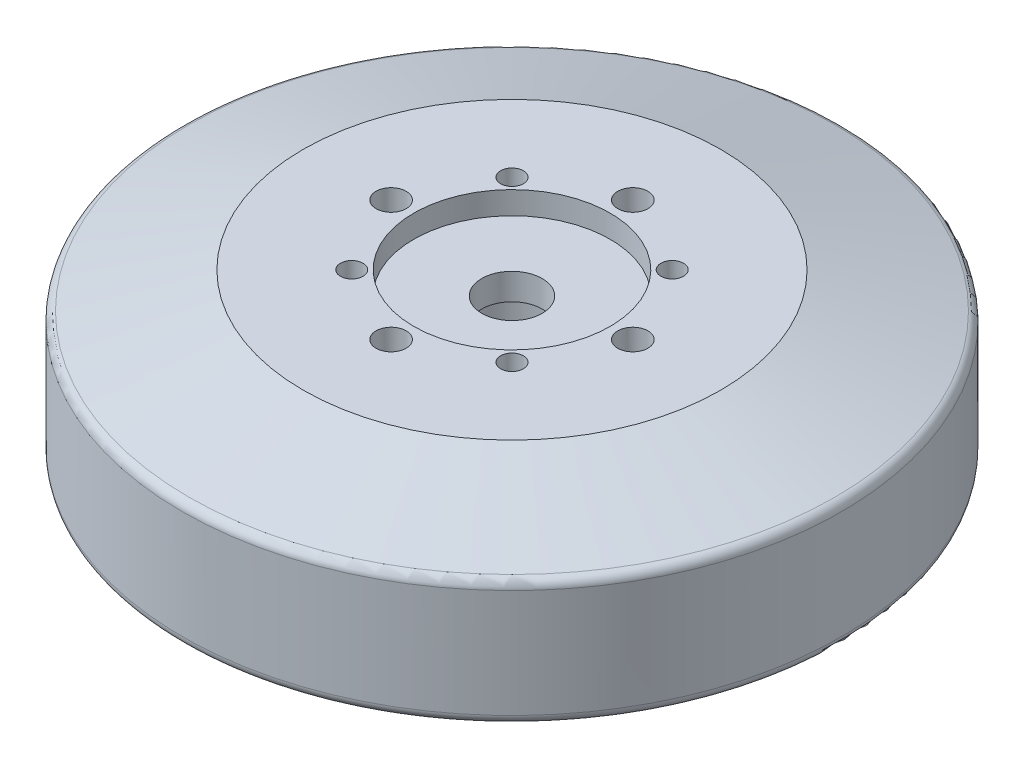
ISO-10303-21;
HEADER;
FILE_DESCRIPTION(('STEP AP214'),'2;1');
FILE_NAME('part.step','',(''),(''),'','','');
FILE_SCHEMA(('AUTOMOTIVE_DESIGN { 1 0 10303 214 1 1 1 1 }'));
ENDSEC;
DATA;
#1=APPLICATION_CONTEXT('core data for automotive mechanical design processes');
#2=APPLICATION_PROTOCOL_DEFINITION('international standard','automotive_design',2000,#1);
#3=PRODUCT_CONTEXT('',#1,'mechanical');
#4=PRODUCT('Part','Part','',(#3));
#5=PRODUCT_RELATED_PRODUCT_CATEGORY('part','',(#4));
#6=PRODUCT_DEFINITION_FORMATION('','',#4);
#7=PRODUCT_DEFINITION_CONTEXT('part definition',#1,'design');
#8=PRODUCT_DEFINITION('design','',#6,#7);
#9=PRODUCT_DEFINITION_SHAPE('','',#8);
#10=(LENGTH_UNIT() NAMED_UNIT(*) SI_UNIT(.MILLI.,.METRE.));
#11=(NAMED_UNIT(*) PLANE_ANGLE_UNIT() SI_UNIT($,.RADIAN.));
#12=(NAMED_UNIT(*) SI_UNIT($,.STERADIAN.) SOLID_ANGLE_UNIT());
#13=UNCERTAINTY_MEASURE_WITH_UNIT(LENGTH_MEASURE(1.E-05),#10,'distance_accuracy_value','');
#14=(GEOMETRIC_REPRESENTATION_CONTEXT(3) GLOBAL_UNCERTAINTY_ASSIGNED_CONTEXT((#13)) GLOBAL_UNIT_ASSIGNED_CONTEXT((#10,
#11,#12)) REPRESENTATION_CONTEXT('',''));
#15=CARTESIAN_POINT('',(0.,0.,0.));
#16=DIRECTION('',(0.,0.,1.));
#17=DIRECTION('',(1.,0.,0.));
#18=AXIS2_PLACEMENT_3D('',#15,#16,#17);
#19=CARTESIAN_POINT('',(0.,0.,0.));
#20=DIRECTION('',(0.,1.,0.));
#21=DIRECTION('',(0.,0.,1.));
#22=AXIS2_PLACEMENT_3D('',#19,#20,#21);
#23=CYLINDRICAL_SURFACE('',#22,4.);
#24=CARTESIAN_POINT('',(0.,23.5,0.));
#25=DIRECTION('',(0.,1.,0.));
#26=DIRECTION('',(0.,0.,1.));
#27=AXIS2_PLACEMENT_3D('',#24,#25,#26);
#28=CIRCLE('',#27,4.);
#29=CARTESIAN_POINT('',(0.,23.5,4.));
#30=VERTEX_POINT('',#29);
#31=EDGE_CURVE('E50',#30,#30,#28,.T.);
#32=ORIENTED_EDGE('',*,*,#31,.T.);
#33=EDGE_LOOP('',(#32));
#34=FACE_BOUND('',#33,.T.);
#35=CARTESIAN_POINT('',(0.,20.,0.));
#36=DIRECTION('',(0.,-1.,0.));
#37=DIRECTION('',(0.,0.,-1.));
#38=AXIS2_PLACEMENT_3D('',#35,#36,#37);
#39=CIRCLE('',#38,4.);
#40=CARTESIAN_POINT('',(0.,20.,-4.));
#41=VERTEX_POINT('',#40);
#42=EDGE_CURVE('E38',#41,#41,#39,.F.);
#43=ORIENTED_EDGE('',*,*,#42,.F.);
#44=EDGE_LOOP('',(#43));
#45=FACE_BOUND('',#44,.T.);
#46=ADVANCED_FACE('F34',(#34,#45),#23,.F.);
#47=CARTESIAN_POINT('',(0.,26.5,0.));
#48=DIRECTION('',(0.,-1.,0.));
#49=DIRECTION('',(0.,0.,-1.));
#50=AXIS2_PLACEMENT_3D('',#47,#48,#49);
#51=CYLINDRICAL_SURFACE('',#50,43.625);
#52=CARTESIAN_POINT('',(0.,6.24363306261844,0.));
#53=DIRECTION('',(0.,-1.,0.));
#54=DIRECTION('',(0.,0.,-1.));
#55=AXIS2_PLACEMENT_3D('',#52,#53,#54);
#56=CIRCLE('',#55,43.625);
#57=CARTESIAN_POINT('',(0.,6.24363306261844,-43.625));
#58=VERTEX_POINT('',#57);
#59=EDGE_CURVE('E47',#58,#58,#56,.F.);
#60=ORIENTED_EDGE('',*,*,#59,.T.);
#61=EDGE_LOOP('',(#60));
#62=FACE_BOUND('',#61,.T.);
#63=CARTESIAN_POINT('',(0.,20.5663075399947,0.));
#64=DIRECTION('',(0.,1.,0.));
#65=DIRECTION('',(0.,0.,1.));
#66=AXIS2_PLACEMENT_3D('',#63,#64,#65);
#67=CIRCLE('',#66,43.625);
#68=CARTESIAN_POINT('',(0.,20.5663075399947,43.625));
#69=VERTEX_POINT('',#68);
#70=EDGE_CURVE('E94',#69,#69,#67,.F.);
#71=ORIENTED_EDGE('',*,*,#70,.T.);
#72=EDGE_LOOP('',(#71));
#73=FACE_BOUND('',#72,.T.);
#74=ADVANCED_FACE('F99',(#62,#73),#51,.T.);
#75=CARTESIAN_POINT('',(0.,26.5,0.));
#76=DIRECTION('',(0.,1.,0.));
#77=DIRECTION('',(0.,0.,1.));
#78=AXIS2_PLACEMENT_3D('',#75,#76,#77);
#79=PLANE('',#78);
#80=CARTESIAN_POINT('',(-10.6066017177983,26.5,-10.6066017177982));
#81=DIRECTION('',(0.,1.,0.));
#82=DIRECTION('',(1.,0.,0.));
#83=AXIS2_PLACEMENT_3D('',#80,#81,#82);
#84=CIRCLE('',#83,1.5);
#85=CARTESIAN_POINT('',(-9.10660171779827,26.5,-10.6066017177982));
#86=VERTEX_POINT('',#85);
#87=EDGE_CURVE('E672',#86,#86,#84,.T.);
#88=ORIENTED_EDGE('',*,*,#87,.F.);
#89=EDGE_LOOP('',(#88));
#90=FACE_BOUND('',#89,.T.);
#91=CARTESIAN_POINT('',(-16.,26.5,0.));
#92=DIRECTION('',(0.,1.,0.));
#93=DIRECTION('',(0.,0.,-1.));
#94=AXIS2_PLACEMENT_3D('',#91,#92,#93);
#95=CIRCLE('',#94,2.);
#96=CARTESIAN_POINT('',(-16.,26.5,-2.));
#97=VERTEX_POINT('',#96);
#98=EDGE_CURVE('E678',#97,#97,#95,.T.);
#99=ORIENTED_EDGE('',*,*,#98,.F.);
#100=EDGE_LOOP('',(#99));
#101=FACE_BOUND('',#100,.T.);
#102=CARTESIAN_POINT('',(-10.6066017177982,26.5,10.6066017177982));
#103=DIRECTION('',(0.,1.,0.));
#104=DIRECTION('',(0.,0.,-1.));
#105=AXIS2_PLACEMENT_3D('',#102,#103,#104);
#106=CIRCLE('',#105,1.5);
#107=CARTESIAN_POINT('',(-10.6066017177982,26.5,9.10660171779823));
#108=VERTEX_POINT('',#107);
#109=EDGE_CURVE('E684',#108,#108,#106,.T.);
#110=ORIENTED_EDGE('',*,*,#109,.F.);
#111=EDGE_LOOP('',(#110));
#112=FACE_BOUND('',#111,.T.);
#113=CARTESIAN_POINT('',(1.6759110426447E-13,26.5,16.));
#114=DIRECTION('',(0.,1.,0.));
#115=DIRECTION('',(-1.,0.,0.));
#116=AXIS2_PLACEMENT_3D('',#113,#114,#115);
#117=CIRCLE('',#116,2.);
#118=CARTESIAN_POINT('',(-1.99999999999984,26.5,16.));
#119=VERTEX_POINT('',#118);
#120=EDGE_CURVE('E690',#119,#119,#117,.T.);
#121=ORIENTED_EDGE('',*,*,#120,.F.);
#122=EDGE_LOOP('',(#121));
#123=FACE_BOUND('',#122,.T.);
#124=CARTESIAN_POINT('',(10.6066017177983,26.5,10.6066017177981));
#125=DIRECTION('',(0.,1.,0.));
#126=DIRECTION('',(-1.,0.,0.));
#127=AXIS2_PLACEMENT_3D('',#124,#125,#126);
#128=CIRCLE('',#127,1.5);
#129=CARTESIAN_POINT('',(9.10660171779834,26.5,10.6066017177981));
#130=VERTEX_POINT('',#129);
#131=EDGE_CURVE('E665',#130,#130,#128,.T.);
#132=ORIENTED_EDGE('',*,*,#131,.F.);
#133=EDGE_LOOP('',(#132));
#134=FACE_BOUND('',#133,.T.);
#135=CARTESIAN_POINT('',(0.,26.5,-16.));
#136=DIRECTION('',(0.,1.,0.));
#137=DIRECTION('',(1.,0.,0.));
#138=AXIS2_PLACEMENT_3D('',#135,#136,#137);
#139=CIRCLE('',#138,2.);
#140=CARTESIAN_POINT('',(1.99999999999995,26.5,-16.));
#141=VERTEX_POINT('',#140);
#142=EDGE_CURVE('E671',#141,#141,#139,.T.);
#143=ORIENTED_EDGE('',*,*,#142,.F.);
#144=EDGE_LOOP('',(#143));
#145=FACE_BOUND('',#144,.T.);
#146=CARTESIAN_POINT('',(0.,26.5,0.));
#147=DIRECTION('',(0.,1.,0.));
#148=DIRECTION('',(0.,0.,1.));
#149=AXIS2_PLACEMENT_3D('',#146,#147,#148);
#150=CIRCLE('',#149,13.);
#151=CARTESIAN_POINT('',(0.,26.5,13.));
#152=VERTEX_POINT('',#151);
#153=EDGE_CURVE('E52',#152,#152,#150,.T.);
#154=ORIENTED_EDGE('',*,*,#153,.F.);
#155=EDGE_LOOP('',(#154));
#156=FACE_BOUND('',#155,.T.);
#157=CARTESIAN_POINT('',(10.6066017177982,26.5,-10.6066017177982));
#158=DIRECTION('',(0.,1.,0.));
#159=DIRECTION('',(0.,0.,1.));
#160=AXIS2_PLACEMENT_3D('',#157,#158,#159);
#161=CIRCLE('',#160,1.5);
#162=CARTESIAN_POINT('',(10.6066017177982,26.5,-9.10660171779823));
#163=VERTEX_POINT('',#162);
#164=EDGE_CURVE('E75',#163,#163,#161,.T.);
#165=ORIENTED_EDGE('',*,*,#164,.F.);
#166=EDGE_LOOP('',(#165));
#167=FACE_BOUND('',#166,.T.);
#168=CARTESIAN_POINT('',(16.,26.5,0.));
#169=DIRECTION('',(0.,1.,0.));
#170=DIRECTION('',(0.,0.,1.));
#171=AXIS2_PLACEMENT_3D('',#168,#169,#170);
#172=CIRCLE('',#171,2.);
#173=CARTESIAN_POINT('',(16.,26.5,2.));
#174=VERTEX_POINT('',#173);
#175=EDGE_CURVE('E80',#174,#174,#172,.T.);
#176=ORIENTED_EDGE('',*,*,#175,.F.);
#177=EDGE_LOOP('',(#176));
#178=FACE_BOUND('',#177,.T.);
#179=CARTESIAN_POINT('',(0.,26.5,0.));
#180=DIRECTION('',(0.,1.,0.));
#181=DIRECTION('',(0.,0.,1.));
#182=AXIS2_PLACEMENT_3D('',#179,#180,#181);
#183=CIRCLE('',#182,27.6249999999998);
#184=CARTESIAN_POINT('',(0.,26.5,27.6249999999998));
#185=VERTEX_POINT('',#184);
#186=EDGE_CURVE('E86',#185,#185,#183,.T.);
#187=ORIENTED_EDGE('',*,*,#186,.T.);
#188=EDGE_LOOP('',(#187));
#189=FACE_BOUND('',#188,.T.);
#190=ADVANCED_FACE('F121',(#90,#101,#112,#123,#134,#145,#156,#167,#178,#189),#79,.T.);
#191=CARTESIAN_POINT('',(0.,0.,0.));
#192=DIRECTION('',(0.,1.,0.));
#193=DIRECTION('',(0.,0.,1.));
#194=AXIS2_PLACEMENT_3D('',#191,#192,#193);
#195=PLANE('',#194);
#196=CARTESIAN_POINT('',(12.3743686707646,0.,-12.3743686707646));
#197=DIRECTION('',(0.,-1.,0.));
#198=DIRECTION('',(0.,0.,1.));
#199=AXIS2_PLACEMENT_3D('',#196,#197,#198);
#200=CIRCLE('',#199,1.5);
#201=CARTESIAN_POINT('',(12.3743686707646,0.,-10.8743686707646));
#202=VERTEX_POINT('',#201);
#203=EDGE_CURVE('E623',#202,#202,#200,.T.);
#204=ORIENTED_EDGE('',*,*,#203,.F.);
#205=EDGE_LOOP('',(#204));
#206=FACE_BOUND('',#205,.T.);
#207=CARTESIAN_POINT('',(-17.5,0.,1.83302770289265E-13));
#208=DIRECTION('',(0.,-1.,0.));
#209=DIRECTION('',(1.,0.,0.));
#210=AXIS2_PLACEMENT_3D('',#207,#208,#209);
#211=CIRCLE('',#210,1.5);
#212=CARTESIAN_POINT('',(-16.,0.,1.6759110426447E-13));
#213=VERTEX_POINT('',#212);
#214=EDGE_CURVE('E637',#213,#213,#211,.T.);
#215=ORIENTED_EDGE('',*,*,#214,.F.);
#216=EDGE_LOOP('',(#215));
#217=FACE_BOUND('',#216,.T.);
#218=CARTESIAN_POINT('',(-12.5,0.,1.30930550206618E-13));
#219=DIRECTION('',(0.,-1.,0.));
#220=DIRECTION('',(1.,0.,0.));
#221=AXIS2_PLACEMENT_3D('',#218,#219,#220);
#222=CIRCLE('',#221,1.5);
#223=CARTESIAN_POINT('',(-11.,0.,1.15218884181823E-13));
#224=VERTEX_POINT('',#223);
#225=EDGE_CURVE('E789',#224,#224,#222,.T.);
#226=ORIENTED_EDGE('',*,*,#225,.F.);
#227=EDGE_LOOP('',(#226));
#228=FACE_BOUND('',#227,.T.);
#229=CARTESIAN_POINT('',(-12.3743686707647,0.,-12.3743686707645));
#230=DIRECTION('',(0.,-1.,0.));
#231=DIRECTION('',(1.,0.,0.));
#232=AXIS2_PLACEMENT_3D('',#229,#230,#231);
#233=CIRCLE('',#232,1.5);
#234=CARTESIAN_POINT('',(-10.8743686707647,0.,-12.3743686707645));
#235=VERTEX_POINT('',#234);
#236=EDGE_CURVE('E632',#235,#235,#233,.T.);
#237=ORIENTED_EDGE('',*,*,#236,.F.);
#238=EDGE_LOOP('',(#237));
#239=FACE_BOUND('',#238,.T.);
#240=CARTESIAN_POINT('',(0.,0.,-12.5));
#241=DIRECTION('',(0.,-1.,0.));
#242=DIRECTION('',(0.,0.,1.));
#243=AXIS2_PLACEMENT_3D('',#240,#241,#242);
#244=CIRCLE('',#243,1.5);
#245=CARTESIAN_POINT('',(0.,0.,-11.));
#246=VERTEX_POINT('',#245);
#247=EDGE_CURVE('E622',#246,#246,#244,.T.);
#248=ORIENTED_EDGE('',*,*,#247,.F.);
#249=EDGE_LOOP('',(#248));
#250=FACE_BOUND('',#249,.T.);
#251=CARTESIAN_POINT('',(0.,0.,-17.5));
#252=DIRECTION('',(0.,-1.,0.));
#253=DIRECTION('',(0.,0.,1.));
#254=AXIS2_PLACEMENT_3D('',#251,#252,#253);
#255=CIRCLE('',#254,1.5);
#256=CARTESIAN_POINT('',(0.,0.,-16.));
#257=VERTEX_POINT('',#256);
#258=EDGE_CURVE('E657',#257,#257,#255,.T.);
#259=ORIENTED_EDGE('',*,*,#258,.F.);
#260=EDGE_LOOP('',(#259));
#261=FACE_BOUND('',#260,.T.);
#262=CARTESIAN_POINT('',(12.3743686707646,0.,12.3743686707646));
#263=DIRECTION('',(0.,-1.,0.));
#264=DIRECTION('',(-1.,0.,0.));
#265=AXIS2_PLACEMENT_3D('',#262,#263,#264);
#266=CIRCLE('',#265,1.5);
#267=CARTESIAN_POINT('',(10.8743686707646,0.,12.3743686707646));
#268=VERTEX_POINT('',#267);
#269=EDGE_CURVE('E651',#268,#268,#266,.T.);
#270=ORIENTED_EDGE('',*,*,#269,.F.);
#271=EDGE_LOOP('',(#270));
#272=FACE_BOUND('',#271,.T.);
#273=CARTESIAN_POINT('',(12.5,0.,0.));
#274=DIRECTION('',(0.,-1.,0.));
#275=DIRECTION('',(-1.,0.,0.));
#276=AXIS2_PLACEMENT_3D('',#273,#274,#275);
#277=CIRCLE('',#276,1.5);
#278=CARTESIAN_POINT('',(11.,0.,0.));
#279=VERTEX_POINT('',#278);
#280=EDGE_CURVE('E645',#279,#279,#277,.T.);
#281=ORIENTED_EDGE('',*,*,#280,.F.);
#282=EDGE_LOOP('',(#281));
#283=FACE_BOUND('',#282,.T.);
#284=CARTESIAN_POINT('',(17.5,0.,0.));
#285=DIRECTION('',(0.,-1.,0.));
#286=DIRECTION('',(-1.,0.,0.));
#287=AXIS2_PLACEMENT_3D('',#284,#285,#286);
#288=CIRCLE('',#287,1.5);
#289=CARTESIAN_POINT('',(16.,0.,0.));
#290=VERTEX_POINT('',#289);
#291=EDGE_CURVE('E644',#290,#290,#288,.T.);
#292=ORIENTED_EDGE('',*,*,#291,.F.);
#293=EDGE_LOOP('',(#292));
#294=FACE_BOUND('',#293,.T.);
#295=CARTESIAN_POINT('',(0.,0.,12.5));
#296=DIRECTION('',(0.,-1.,0.));
#297=DIRECTION('',(0.,0.,-1.));
#298=AXIS2_PLACEMENT_3D('',#295,#296,#297);
#299=CIRCLE('',#298,1.5);
#300=CARTESIAN_POINT('',(0.,0.,11.));
#301=VERTEX_POINT('',#300);
#302=EDGE_CURVE('E707',#301,#301,#299,.T.);
#303=ORIENTED_EDGE('',*,*,#302,.F.);
#304=EDGE_LOOP('',(#303));
#305=FACE_BOUND('',#304,.T.);
#306=CARTESIAN_POINT('',(-12.3743686707646,0.,12.3743686707646));
#307=DIRECTION('',(0.,-1.,0.));
#308=DIRECTION('',(0.,0.,-1.));
#309=AXIS2_PLACEMENT_3D('',#306,#307,#308);
#310=CIRCLE('',#309,1.5);
#311=CARTESIAN_POINT('',(-12.3743686707646,0.,10.8743686707646));
#312=VERTEX_POINT('',#311);
#313=EDGE_CURVE('E701',#312,#312,#310,.T.);
#314=ORIENTED_EDGE('',*,*,#313,.F.);
#315=EDGE_LOOP('',(#314));
#316=FACE_BOUND('',#315,.T.);
#317=CARTESIAN_POINT('',(0.,0.,17.5));
#318=DIRECTION('',(0.,-1.,0.));
#319=DIRECTION('',(0.,0.,-1.));
#320=AXIS2_PLACEMENT_3D('',#317,#318,#319);
#321=CIRCLE('',#320,1.5);
#322=CARTESIAN_POINT('',(0.,0.,16.));
#323=VERTEX_POINT('',#322);
#324=EDGE_CURVE('E71',#323,#323,#321,.T.);
#325=ORIENTED_EDGE('',*,*,#324,.F.);
#326=EDGE_LOOP('',(#325));
#327=FACE_BOUND('',#326,.T.);
#328=CARTESIAN_POINT('',(0.,0.,0.));
#329=DIRECTION('',(0.,-1.,0.));
#330=DIRECTION('',(0.,0.,-1.));
#331=AXIS2_PLACEMENT_3D('',#328,#329,#330);
#332=CIRCLE('',#331,6.35);
#333=CARTESIAN_POINT('',(0.,0.,-6.35));
#334=VERTEX_POINT('',#333);
#335=EDGE_CURVE('E63',#334,#334,#332,.T.);
#336=ORIENTED_EDGE('',*,*,#335,.F.);
#337=EDGE_LOOP('',(#336));
#338=FACE_BOUND('',#337,.T.);
#339=CARTESIAN_POINT('',(0.,0.,0.));
#340=DIRECTION('',(0.,1.,0.));
#341=DIRECTION('',(0.,0.,1.));
#342=AXIS2_PLACEMENT_3D('',#339,#340,#341);
#343=CIRCLE('',#342,20.6249999999996);
#344=CARTESIAN_POINT('',(0.,0.,20.6249999999996));
#345=VERTEX_POINT('',#344);
#346=EDGE_CURVE('E91',#345,#345,#343,.F.);
#347=ORIENTED_EDGE('',*,*,#346,.T.);
#348=EDGE_LOOP('',(#347));
#349=FACE_BOUND('',#348,.T.);
#350=ADVANCED_FACE('F154',(#206,#217,#228,#239,#250,#261,#272,#283,#294,#305,#316,#327,#338,
#349),#195,.F.);
#351=CARTESIAN_POINT('',(0.,26.5,0.));
#352=DIRECTION('',(0.,-1.,0.));
#353=DIRECTION('',(0.,0.,-1.));
#354=AXIS2_PLACEMENT_3D('',#351,#352,#353);
#355=CONICAL_SURFACE('',#354,27.6249999999998,1.26791145841993);
#356=CARTESIAN_POINT('',(0.,21.7784971120991,0.));
#357=DIRECTION('',(0.,-1.,0.));
#358=DIRECTION('',(0.,0.,-1.));
#359=AXIS2_PLACEMENT_3D('',#356,#357,#358);
#360=CIRCLE('',#359,42.7338092412826);
#361=CARTESIAN_POINT('',(0.,21.7784971120991,-42.7338092412826));
#362=VERTEX_POINT('',#361);
#363=EDGE_CURVE('E10',#362,#362,#360,.F.);
#364=ORIENTED_EDGE('',*,*,#363,.T.);
#365=EDGE_LOOP('',(#364));
#366=FACE_BOUND('',#365,.T.);
#367=ORIENTED_EDGE('',*,*,#186,.F.);
#368=EDGE_LOOP('',(#367));
#369=FACE_BOUND('',#368,.T.);
#370=ADVANCED_FACE('F150',(#366,#369),#355,.T.);
#371=CARTESIAN_POINT('',(16.,20.5,0.));
#372=DIRECTION('',(0.,1.,0.));
#373=DIRECTION('',(0.,0.,1.));
#374=AXIS2_PLACEMENT_3D('',#371,#372,#373);
#375=CYLINDRICAL_SURFACE('',#374,2.);
#376=CARTESIAN_POINT('',(16.,20.5,0.));
#377=DIRECTION('',(0.,1.,0.));
#378=DIRECTION('',(0.,0.,1.));
#379=AXIS2_PLACEMENT_3D('',#376,#377,#378);
#380=CIRCLE('',#379,2.);
#381=CARTESIAN_POINT('',(16.,20.5,2.));
#382=VERTEX_POINT('',#381);
#383=EDGE_CURVE('E83',#382,#382,#380,.T.);
#384=ORIENTED_EDGE('',*,*,#383,.F.);
#385=EDGE_LOOP('',(#384));
#386=FACE_BOUND('',#385,.T.);
#387=ORIENTED_EDGE('',*,*,#175,.T.);
#388=EDGE_LOOP('',(#387));
#389=FACE_BOUND('',#388,.T.);
#390=ADVANCED_FACE('F146',(#386,#389),#375,.F.);
#391=CARTESIAN_POINT('',(16.,20.5,0.));
#392=DIRECTION('',(0.,1.,0.));
#393=DIRECTION('',(0.,0.,1.));
#394=AXIS2_PLACEMENT_3D('',#391,#392,#393);
#395=PLANE('',#394);
#396=ORIENTED_EDGE('',*,*,#383,.T.);
#397=EDGE_LOOP('',(#396));
#398=FACE_BOUND('',#397,.T.);
#399=ADVANCED_FACE('F142',(#398),#395,.T.);
#400=CARTESIAN_POINT('',(10.6066017177982,20.5,-10.6066017177982));
#401=DIRECTION('',(0.,1.,0.));
#402=DIRECTION('',(0.,0.,1.));
#403=AXIS2_PLACEMENT_3D('',#400,#401,#402);
#404=CYLINDRICAL_SURFACE('',#403,1.5);
#405=CARTESIAN_POINT('',(10.6066017177982,20.5,-10.6066017177982));
#406=DIRECTION('',(0.,1.,0.));
#407=DIRECTION('',(0.,0.,1.));
#408=AXIS2_PLACEMENT_3D('',#405,#406,#407);
#409=CIRCLE('',#408,1.5);
#410=CARTESIAN_POINT('',(10.6066017177982,20.5,-9.10660171779823));
#411=VERTEX_POINT('',#410);
#412=EDGE_CURVE('E77',#411,#411,#409,.T.);
#413=ORIENTED_EDGE('',*,*,#412,.F.);
#414=EDGE_LOOP('',(#413));
#415=FACE_BOUND('',#414,.T.);
#416=ORIENTED_EDGE('',*,*,#164,.T.);
#417=EDGE_LOOP('',(#416));
#418=FACE_BOUND('',#417,.T.);
#419=ADVANCED_FACE('F138',(#415,#418),#404,.F.);
#420=CARTESIAN_POINT('',(10.6066017177982,20.5,-10.6066017177982));
#421=DIRECTION('',(0.,1.,0.));
#422=DIRECTION('',(0.,0.,1.));
#423=AXIS2_PLACEMENT_3D('',#420,#421,#422);
#424=PLANE('',#423);
#425=ORIENTED_EDGE('',*,*,#412,.T.);
#426=EDGE_LOOP('',(#425));
#427=FACE_BOUND('',#426,.T.);
#428=ADVANCED_FACE('F134',(#427),#424,.T.);
#429=CARTESIAN_POINT('',(0.,23.5,0.));
#430=DIRECTION('',(0.,1.,0.));
#431=DIRECTION('',(0.,0.,1.));
#432=AXIS2_PLACEMENT_3D('',#429,#430,#431);
#433=CYLINDRICAL_SURFACE('',#432,13.);
#434=CARTESIAN_POINT('',(0.,23.5,0.));
#435=DIRECTION('',(0.,1.,0.));
#436=DIRECTION('',(0.,0.,1.));
#437=AXIS2_PLACEMENT_3D('',#434,#435,#436);
#438=CIRCLE('',#437,13.);
#439=CARTESIAN_POINT('',(0.,23.5,13.));
#440=VERTEX_POINT('',#439);
#441=EDGE_CURVE('E56',#440,#440,#438,.T.);
#442=ORIENTED_EDGE('',*,*,#441,.F.);
#443=EDGE_LOOP('',(#442));
#444=FACE_BOUND('',#443,.T.);
#445=ORIENTED_EDGE('',*,*,#153,.T.);
#446=EDGE_LOOP('',(#445));
#447=FACE_BOUND('',#446,.T.);
#448=ADVANCED_FACE('F130',(#444,#447),#433,.F.);
#449=CARTESIAN_POINT('',(0.,23.5,0.));
#450=DIRECTION('',(0.,1.,0.));
#451=DIRECTION('',(0.,0.,1.));
#452=AXIS2_PLACEMENT_3D('',#449,#450,#451);
#453=PLANE('',#452);
#454=ORIENTED_EDGE('',*,*,#31,.F.);
#455=EDGE_LOOP('',(#454));
#456=FACE_BOUND('',#455,.T.);
#457=ORIENTED_EDGE('',*,*,#441,.T.);
#458=EDGE_LOOP('',(#457));
#459=FACE_BOUND('',#458,.T.);
#460=ADVANCED_FACE('F112',(#456,#459),#453,.T.);
#461=CARTESIAN_POINT('',(0.,5.23000000000001,0.));
#462=DIRECTION('',(0.,1.,0.));
#463=DIRECTION('',(0.,0.,1.));
#464=AXIS2_PLACEMENT_3D('',#461,#462,#463);
#465=CONICAL_SURFACE('',#464,43.625,1.34720697549032);
#466=CARTESIAN_POINT('',(0.,5.005246078161,0.));
#467=DIRECTION('',(0.,1.,0.));
#468=DIRECTION('',(0.,0.,1.));
#469=AXIS2_PLACEMENT_3D('',#466,#467,#468);
#470=CIRCLE('',#469,42.6365984316831);
#471=CARTESIAN_POINT('',(0.,5.005246078161,42.6365984316831));
#472=VERTEX_POINT('',#471);
#473=EDGE_CURVE('E42',#472,#472,#470,.F.);
#474=ORIENTED_EDGE('',*,*,#473,.T.);
#475=EDGE_LOOP('',(#474));
#476=FACE_BOUND('',#475,.T.);
#477=ORIENTED_EDGE('',*,*,#346,.F.);
#478=EDGE_LOOP('',(#477));
#479=FACE_BOUND('',#478,.T.);
#480=ADVANCED_FACE('F104',(#476,#479),#465,.T.);
#481=CARTESIAN_POINT('',(0.,6.24363306261844,0.));
#482=DIRECTION('',(0.,-1.,0.));
#483=DIRECTION('',(0.,0.,-1.));
#484=AXIS2_PLACEMENT_3D('',#481,#482,#483);
#485=TOROIDAL_SURFACE('',#484,42.355,1.27);
#486=ORIENTED_EDGE('',*,*,#473,.F.);
#487=EDGE_LOOP('',(#486));
#488=FACE_BOUND('',#487,.T.);
#489=ORIENTED_EDGE('',*,*,#59,.F.);
#490=EDGE_LOOP('',(#489));
#491=FACE_BOUND('',#490,.T.);
#492=ADVANCED_FACE('F102',(#488,#491),#485,.T.);
#493=CARTESIAN_POINT('',(0.,20.5663075399947,0.));
#494=DIRECTION('',(0.,1.,0.));
#495=DIRECTION('',(0.,0.,1.));
#496=AXIS2_PLACEMENT_3D('',#493,#494,#495);
#497=TOROIDAL_SURFACE('',#496,42.355,1.27);
#498=ORIENTED_EDGE('',*,*,#363,.F.);
#499=EDGE_LOOP('',(#498));
#500=FACE_BOUND('',#499,.T.);
#501=ORIENTED_EDGE('',*,*,#70,.F.);
#502=EDGE_LOOP('',(#501));
#503=FACE_BOUND('',#502,.T.);
#504=ADVANCED_FACE('F36',(#500,#503),#497,.T.);
#505=CARTESIAN_POINT('',(0.,20.,0.));
#506=DIRECTION('',(0.,-1.,0.));
#507=DIRECTION('',(0.,0.,-1.));
#508=AXIS2_PLACEMENT_3D('',#505,#506,#507);
#509=PLANE('',#508);
#510=CARTESIAN_POINT('',(0.,20.,0.));
#511=DIRECTION('',(0.,-1.,0.));
#512=DIRECTION('',(0.,0.,-1.));
#513=AXIS2_PLACEMENT_3D('',#510,#511,#512);
#514=CIRCLE('',#513,6.35);
#515=CARTESIAN_POINT('',(0.,20.,-6.35));
#516=VERTEX_POINT('',#515);
#517=EDGE_CURVE('E59',#516,#516,#514,.T.);
#518=ORIENTED_EDGE('',*,*,#517,.T.);
#519=EDGE_LOOP('',(#518));
#520=FACE_BOUND('',#519,.T.);
#521=ORIENTED_EDGE('',*,*,#42,.T.);
#522=EDGE_LOOP('',(#521));
#523=FACE_BOUND('',#522,.T.);
#524=ADVANCED_FACE('F110',(#520,#523),#509,.T.);
#525=CARTESIAN_POINT('',(0.,20.,0.));
#526=DIRECTION('',(0.,-1.,0.));
#527=DIRECTION('',(0.,0.,-1.));
#528=AXIS2_PLACEMENT_3D('',#525,#526,#527);
#529=CYLINDRICAL_SURFACE('',#528,6.35);
#530=ORIENTED_EDGE('',*,*,#517,.F.);
#531=EDGE_LOOP('',(#530));
#532=FACE_BOUND('',#531,.T.);
#533=ORIENTED_EDGE('',*,*,#335,.T.);
#534=EDGE_LOOP('',(#533));
#535=FACE_BOUND('',#534,.T.);
#536=ADVANCED_FACE('F126',(#532,#535),#529,.F.);
#537=CARTESIAN_POINT('',(0.,6.,17.5));
#538=DIRECTION('',(0.,-1.,0.));
#539=DIRECTION('',(0.,0.,-1.));
#540=AXIS2_PLACEMENT_3D('',#537,#538,#539);
#541=CYLINDRICAL_SURFACE('',#540,1.5);
#542=CARTESIAN_POINT('',(0.,6.,17.5));
#543=DIRECTION('',(0.,-1.,0.));
#544=DIRECTION('',(0.,0.,-1.));
#545=AXIS2_PLACEMENT_3D('',#542,#543,#544);
#546=CIRCLE('',#545,1.5);
#547=CARTESIAN_POINT('',(0.,6.,16.));
#548=VERTEX_POINT('',#547);
#549=EDGE_CURVE('E68',#548,#548,#546,.T.);
#550=ORIENTED_EDGE('',*,*,#549,.F.);
#551=EDGE_LOOP('',(#550));
#552=FACE_BOUND('',#551,.T.);
#553=ORIENTED_EDGE('',*,*,#324,.T.);
#554=EDGE_LOOP('',(#553));
#555=FACE_BOUND('',#554,.T.);
#556=ADVANCED_FACE('F242',(#552,#555),#541,.F.);
#557=CARTESIAN_POINT('',(0.,6.,17.5));
#558=DIRECTION('',(0.,-1.,0.));
#559=DIRECTION('',(0.,0.,-1.));
#560=AXIS2_PLACEMENT_3D('',#557,#558,#559);
#561=PLANE('',#560);
#562=ORIENTED_EDGE('',*,*,#549,.T.);
#563=EDGE_LOOP('',(#562));
#564=FACE_BOUND('',#563,.T.);
#565=ADVANCED_FACE('F252',(#564),#561,.T.);
#566=CARTESIAN_POINT('',(-12.3743686707646,6.,12.3743686707646));
#567=DIRECTION('',(0.,-1.,0.));
#568=DIRECTION('',(0.,0.,-1.));
#569=AXIS2_PLACEMENT_3D('',#566,#567,#568);
#570=CYLINDRICAL_SURFACE('',#569,1.5);
#571=CARTESIAN_POINT('',(-12.3743686707646,6.,12.3743686707646));
#572=DIRECTION('',(0.,-1.,0.));
#573=DIRECTION('',(0.,0.,-1.));
#574=AXIS2_PLACEMENT_3D('',#571,#572,#573);
#575=CIRCLE('',#574,1.5);
#576=CARTESIAN_POINT('',(-12.3743686707646,6.,10.8743686707646));
#577=VERTEX_POINT('',#576);
#578=EDGE_CURVE('E710',#577,#577,#575,.T.);
#579=ORIENTED_EDGE('',*,*,#578,.F.);
#580=EDGE_LOOP('',(#579));
#581=FACE_BOUND('',#580,.T.);
#582=ORIENTED_EDGE('',*,*,#313,.T.);
#583=EDGE_LOOP('',(#582));
#584=FACE_BOUND('',#583,.T.);
#585=ADVANCED_FACE('F262',(#581,#584),#570,.F.);
#586=CARTESIAN_POINT('',(-12.3743686707646,6.,12.3743686707646));
#587=DIRECTION('',(0.,-1.,0.));
#588=DIRECTION('',(0.,0.,-1.));
#589=AXIS2_PLACEMENT_3D('',#586,#587,#588);
#590=PLANE('',#589);
#591=ORIENTED_EDGE('',*,*,#578,.T.);
#592=EDGE_LOOP('',(#591));
#593=FACE_BOUND('',#592,.T.);
#594=ADVANCED_FACE('F272',(#593),#590,.T.);
#595=CARTESIAN_POINT('',(0.,6.,12.5));
#596=DIRECTION('',(0.,-1.,0.));
#597=DIRECTION('',(0.,0.,-1.));
#598=AXIS2_PLACEMENT_3D('',#595,#596,#597);
#599=CYLINDRICAL_SURFACE('',#598,1.5);
#600=CARTESIAN_POINT('',(0.,6.,12.5));
#601=DIRECTION('',(0.,-1.,0.));
#602=DIRECTION('',(0.,0.,-1.));
#603=AXIS2_PLACEMENT_3D('',#600,#601,#602);
#604=CIRCLE('',#603,1.5);
#605=CARTESIAN_POINT('',(0.,6.,11.));
#606=VERTEX_POINT('',#605);
#607=EDGE_CURVE('E704',#606,#606,#604,.T.);
#608=ORIENTED_EDGE('',*,*,#607,.F.);
#609=EDGE_LOOP('',(#608));
#610=FACE_BOUND('',#609,.T.);
#611=ORIENTED_EDGE('',*,*,#302,.T.);
#612=EDGE_LOOP('',(#611));
#613=FACE_BOUND('',#612,.T.);
#614=ADVANCED_FACE('F282',(#610,#613),#599,.F.);
#615=CARTESIAN_POINT('',(0.,6.,12.5));
#616=DIRECTION('',(0.,-1.,0.));
#617=DIRECTION('',(0.,0.,-1.));
#618=AXIS2_PLACEMENT_3D('',#615,#616,#617);
#619=PLANE('',#618);
#620=ORIENTED_EDGE('',*,*,#607,.T.);
#621=EDGE_LOOP('',(#620));
#622=FACE_BOUND('',#621,.T.);
#623=ADVANCED_FACE('F292',(#622),#619,.T.);
#624=CARTESIAN_POINT('',(0.,20.5,-16.));
#625=DIRECTION('',(0.,1.,0.));
#626=DIRECTION('',(0.,0.,1.));
#627=AXIS2_PLACEMENT_3D('',#624,#625,#626);
#628=CYLINDRICAL_SURFACE('',#627,2.);
#629=CARTESIAN_POINT('',(0.,20.5,-16.));
#630=DIRECTION('',(0.,1.,0.));
#631=DIRECTION('',(1.,0.,0.));
#632=AXIS2_PLACEMENT_3D('',#629,#630,#631);
#633=CIRCLE('',#632,2.);
#634=CARTESIAN_POINT('',(1.99999999999995,20.5,-16.));
#635=VERTEX_POINT('',#634);
#636=EDGE_CURVE('E698',#635,#635,#633,.T.);
#637=ORIENTED_EDGE('',*,*,#636,.F.);
#638=EDGE_LOOP('',(#637));
#639=FACE_BOUND('',#638,.T.);
#640=ORIENTED_EDGE('',*,*,#142,.T.);
#641=EDGE_LOOP('',(#640));
#642=FACE_BOUND('',#641,.T.);
#643=ADVANCED_FACE('F302',(#639,#642),#628,.F.);
#644=CARTESIAN_POINT('',(0.,20.5,-16.));
#645=DIRECTION('',(0.,1.,0.));
#646=DIRECTION('',(1.,0.,0.));
#647=AXIS2_PLACEMENT_3D('',#644,#645,#646);
#648=PLANE('',#647);
#649=ORIENTED_EDGE('',*,*,#636,.T.);
#650=EDGE_LOOP('',(#649));
#651=FACE_BOUND('',#650,.T.);
#652=ADVANCED_FACE('F325',(#651),#648,.T.);
#653=CARTESIAN_POINT('',(10.6066017177983,20.5,10.6066017177981));
#654=DIRECTION('',(0.,1.,0.));
#655=DIRECTION('',(0.,0.,1.));
#656=AXIS2_PLACEMENT_3D('',#653,#654,#655);
#657=CYLINDRICAL_SURFACE('',#656,1.5);
#658=CARTESIAN_POINT('',(10.6066017177983,20.5,10.6066017177981));
#659=DIRECTION('',(0.,1.,0.));
#660=DIRECTION('',(-1.,0.,0.));
#661=AXIS2_PLACEMENT_3D('',#658,#659,#660);
#662=CIRCLE('',#661,1.5);
#663=CARTESIAN_POINT('',(9.10660171779834,20.5,10.6066017177981));
#664=VERTEX_POINT('',#663);
#665=EDGE_CURVE('E693',#664,#664,#662,.T.);
#666=ORIENTED_EDGE('',*,*,#665,.F.);
#667=EDGE_LOOP('',(#666));
#668=FACE_BOUND('',#667,.T.);
#669=ORIENTED_EDGE('',*,*,#131,.T.);
#670=EDGE_LOOP('',(#669));
#671=FACE_BOUND('',#670,.T.);
#672=ADVANCED_FACE('F335',(#668,#671),#657,.F.);
#673=CARTESIAN_POINT('',(10.6066017177983,20.5,10.6066017177981));
#674=DIRECTION('',(0.,1.,0.));
#675=DIRECTION('',(-1.,0.,0.));
#676=AXIS2_PLACEMENT_3D('',#673,#674,#675);
#677=PLANE('',#676);
#678=ORIENTED_EDGE('',*,*,#665,.T.);
#679=EDGE_LOOP('',(#678));
#680=FACE_BOUND('',#679,.T.);
#681=ADVANCED_FACE('F345',(#680),#677,.T.);
#682=CARTESIAN_POINT('',(1.6759110426447E-13,20.5,16.));
#683=DIRECTION('',(0.,1.,0.));
#684=DIRECTION('',(0.,0.,1.));
#685=AXIS2_PLACEMENT_3D('',#682,#683,#684);
#686=CYLINDRICAL_SURFACE('',#685,2.);
#687=CARTESIAN_POINT('',(1.6759110426447E-13,20.5,16.));
#688=DIRECTION('',(0.,1.,0.));
#689=DIRECTION('',(-1.,0.,0.));
#690=AXIS2_PLACEMENT_3D('',#687,#688,#689);
#691=CIRCLE('',#690,2.);
#692=CARTESIAN_POINT('',(-1.99999999999984,20.5,16.));
#693=VERTEX_POINT('',#692);
#694=EDGE_CURVE('E687',#693,#693,#691,.T.);
#695=ORIENTED_EDGE('',*,*,#694,.F.);
#696=EDGE_LOOP('',(#695));
#697=FACE_BOUND('',#696,.T.);
#698=ORIENTED_EDGE('',*,*,#120,.T.);
#699=EDGE_LOOP('',(#698));
#700=FACE_BOUND('',#699,.T.);
#701=ADVANCED_FACE('F355',(#697,#700),#686,.F.);
#702=CARTESIAN_POINT('',(1.6759110426447E-13,20.5,16.));
#703=DIRECTION('',(0.,1.,0.));
#704=DIRECTION('',(-1.,0.,0.));
#705=AXIS2_PLACEMENT_3D('',#702,#703,#704);
#706=PLANE('',#705);
#707=ORIENTED_EDGE('',*,*,#694,.T.);
#708=EDGE_LOOP('',(#707));
#709=FACE_BOUND('',#708,.T.);
#710=ADVANCED_FACE('F365',(#709),#706,.T.);
#711=CARTESIAN_POINT('',(-10.6066017177982,20.5,10.6066017177982));
#712=DIRECTION('',(0.,1.,0.));
#713=DIRECTION('',(0.,0.,1.));
#714=AXIS2_PLACEMENT_3D('',#711,#712,#713);
#715=CYLINDRICAL_SURFACE('',#714,1.5);
#716=CARTESIAN_POINT('',(-10.6066017177982,20.5,10.6066017177982));
#717=DIRECTION('',(0.,1.,0.));
#718=DIRECTION('',(0.,0.,-1.));
#719=AXIS2_PLACEMENT_3D('',#716,#717,#718);
#720=CIRCLE('',#719,1.5);
#721=CARTESIAN_POINT('',(-10.6066017177982,20.5,9.10660171779823));
#722=VERTEX_POINT('',#721);
#723=EDGE_CURVE('E681',#722,#722,#720,.T.);
#724=ORIENTED_EDGE('',*,*,#723,.F.);
#725=EDGE_LOOP('',(#724));
#726=FACE_BOUND('',#725,.T.);
#727=ORIENTED_EDGE('',*,*,#109,.T.);
#728=EDGE_LOOP('',(#727));
#729=FACE_BOUND('',#728,.T.);
#730=ADVANCED_FACE('F375',(#726,#729),#715,.F.);
#731=CARTESIAN_POINT('',(-10.6066017177982,20.5,10.6066017177982));
#732=DIRECTION('',(0.,1.,0.));
#733=DIRECTION('',(0.,0.,-1.));
#734=AXIS2_PLACEMENT_3D('',#731,#732,#733);
#735=PLANE('',#734);
#736=ORIENTED_EDGE('',*,*,#723,.T.);
#737=EDGE_LOOP('',(#736));
#738=FACE_BOUND('',#737,.T.);
#739=ADVANCED_FACE('F385',(#738),#735,.T.);
#740=CARTESIAN_POINT('',(-16.,20.5,0.));
#741=DIRECTION('',(0.,1.,0.));
#742=DIRECTION('',(0.,0.,1.));
#743=AXIS2_PLACEMENT_3D('',#740,#741,#742);
#744=CYLINDRICAL_SURFACE('',#743,2.);
#745=CARTESIAN_POINT('',(-16.,20.5,0.));
#746=DIRECTION('',(0.,1.,0.));
#747=DIRECTION('',(0.,0.,-1.));
#748=AXIS2_PLACEMENT_3D('',#745,#746,#747);
#749=CIRCLE('',#748,2.);
#750=CARTESIAN_POINT('',(-16.,20.5,-2.));
#751=VERTEX_POINT('',#750);
#752=EDGE_CURVE('E675',#751,#751,#749,.T.);
#753=ORIENTED_EDGE('',*,*,#752,.F.);
#754=EDGE_LOOP('',(#753));
#755=FACE_BOUND('',#754,.T.);
#756=ORIENTED_EDGE('',*,*,#98,.T.);
#757=EDGE_LOOP('',(#756));
#758=FACE_BOUND('',#757,.T.);
#759=ADVANCED_FACE('F395',(#755,#758),#744,.F.);
#760=CARTESIAN_POINT('',(-16.,20.5,0.));
#761=DIRECTION('',(0.,1.,0.));
#762=DIRECTION('',(0.,0.,-1.));
#763=AXIS2_PLACEMENT_3D('',#760,#761,#762);
#764=PLANE('',#763);
#765=ORIENTED_EDGE('',*,*,#752,.T.);
#766=EDGE_LOOP('',(#765));
#767=FACE_BOUND('',#766,.T.);
#768=ADVANCED_FACE('F405',(#767),#764,.T.);
#769=CARTESIAN_POINT('',(-10.6066017177983,20.5,-10.6066017177982));
#770=DIRECTION('',(0.,1.,0.));
#771=DIRECTION('',(0.,0.,1.));
#772=AXIS2_PLACEMENT_3D('',#769,#770,#771);
#773=CYLINDRICAL_SURFACE('',#772,1.5);
#774=CARTESIAN_POINT('',(-10.6066017177983,20.5,-10.6066017177982));
#775=DIRECTION('',(0.,1.,0.));
#776=DIRECTION('',(1.,0.,0.));
#777=AXIS2_PLACEMENT_3D('',#774,#775,#776);
#778=CIRCLE('',#777,1.5);
#779=CARTESIAN_POINT('',(-9.10660171779827,20.5,-10.6066017177982));
#780=VERTEX_POINT('',#779);
#781=EDGE_CURVE('E668',#780,#780,#778,.T.);
#782=ORIENTED_EDGE('',*,*,#781,.F.);
#783=EDGE_LOOP('',(#782));
#784=FACE_BOUND('',#783,.T.);
#785=ORIENTED_EDGE('',*,*,#87,.T.);
#786=EDGE_LOOP('',(#785));
#787=FACE_BOUND('',#786,.T.);
#788=ADVANCED_FACE('F415',(#784,#787),#773,.F.);
#789=CARTESIAN_POINT('',(-10.6066017177983,20.5,-10.6066017177982));
#790=DIRECTION('',(0.,1.,0.));
#791=DIRECTION('',(1.,0.,0.));
#792=AXIS2_PLACEMENT_3D('',#789,#790,#791);
#793=PLANE('',#792);
#794=ORIENTED_EDGE('',*,*,#781,.T.);
#795=EDGE_LOOP('',(#794));
#796=FACE_BOUND('',#795,.T.);
#797=ADVANCED_FACE('F425',(#796),#793,.T.);
#798=CARTESIAN_POINT('',(17.5,6.,0.));
#799=DIRECTION('',(0.,-1.,0.));
#800=DIRECTION('',(0.,0.,-1.));
#801=AXIS2_PLACEMENT_3D('',#798,#799,#800);
#802=CYLINDRICAL_SURFACE('',#801,1.5);
#803=CARTESIAN_POINT('',(17.5,6.,0.));
#804=DIRECTION('',(0.,-1.,0.));
#805=DIRECTION('',(-1.,0.,0.));
#806=AXIS2_PLACEMENT_3D('',#803,#804,#805);
#807=CIRCLE('',#806,1.5);
#808=CARTESIAN_POINT('',(16.,6.,0.));
#809=VERTEX_POINT('',#808);
#810=EDGE_CURVE('E662',#809,#809,#807,.T.);
#811=ORIENTED_EDGE('',*,*,#810,.F.);
#812=EDGE_LOOP('',(#811));
#813=FACE_BOUND('',#812,.T.);
#814=ORIENTED_EDGE('',*,*,#291,.T.);
#815=EDGE_LOOP('',(#814));
#816=FACE_BOUND('',#815,.T.);
#817=ADVANCED_FACE('F435',(#813,#816),#802,.F.);
#818=CARTESIAN_POINT('',(17.5,6.,0.));
#819=DIRECTION('',(0.,-1.,0.));
#820=DIRECTION('',(-1.,0.,0.));
#821=AXIS2_PLACEMENT_3D('',#818,#819,#820);
#822=PLANE('',#821);
#823=ORIENTED_EDGE('',*,*,#810,.T.);
#824=EDGE_LOOP('',(#823));
#825=FACE_BOUND('',#824,.T.);
#826=ADVANCED_FACE('F445',(#825),#822,.T.);
#827=CARTESIAN_POINT('',(12.5,6.,0.));
#828=DIRECTION('',(0.,-1.,0.));
#829=DIRECTION('',(0.,0.,-1.));
#830=AXIS2_PLACEMENT_3D('',#827,#828,#829);
#831=CYLINDRICAL_SURFACE('',#830,1.5);
#832=CARTESIAN_POINT('',(12.5,6.,0.));
#833=DIRECTION('',(0.,-1.,0.));
#834=DIRECTION('',(-1.,0.,0.));
#835=AXIS2_PLACEMENT_3D('',#832,#833,#834);
#836=CIRCLE('',#835,1.5);
#837=CARTESIAN_POINT('',(11.,6.,0.));
#838=VERTEX_POINT('',#837);
#839=EDGE_CURVE('E641',#838,#838,#836,.T.);
#840=ORIENTED_EDGE('',*,*,#839,.F.);
#841=EDGE_LOOP('',(#840));
#842=FACE_BOUND('',#841,.T.);
#843=ORIENTED_EDGE('',*,*,#280,.T.);
#844=EDGE_LOOP('',(#843));
#845=FACE_BOUND('',#844,.T.);
#846=ADVANCED_FACE('F455',(#842,#845),#831,.F.);
#847=CARTESIAN_POINT('',(12.5,6.,0.));
#848=DIRECTION('',(0.,-1.,0.));
#849=DIRECTION('',(-1.,0.,0.));
#850=AXIS2_PLACEMENT_3D('',#847,#848,#849);
#851=PLANE('',#850);
#852=ORIENTED_EDGE('',*,*,#839,.T.);
#853=EDGE_LOOP('',(#852));
#854=FACE_BOUND('',#853,.T.);
#855=ADVANCED_FACE('F465',(#854),#851,.T.);
#856=CARTESIAN_POINT('',(12.3743686707646,6.,12.3743686707646));
#857=DIRECTION('',(0.,-1.,0.));
#858=DIRECTION('',(0.,0.,-1.));
#859=AXIS2_PLACEMENT_3D('',#856,#857,#858);
#860=CYLINDRICAL_SURFACE('',#859,1.5);
#861=CARTESIAN_POINT('',(12.3743686707646,6.,12.3743686707646));
#862=DIRECTION('',(0.,-1.,0.));
#863=DIRECTION('',(-1.,0.,0.));
#864=AXIS2_PLACEMENT_3D('',#861,#862,#863);
#865=CIRCLE('',#864,1.5);
#866=CARTESIAN_POINT('',(10.8743686707646,6.,12.3743686707646));
#867=VERTEX_POINT('',#866);
#868=EDGE_CURVE('E648',#867,#867,#865,.T.);
#869=ORIENTED_EDGE('',*,*,#868,.F.);
#870=EDGE_LOOP('',(#869));
#871=FACE_BOUND('',#870,.T.);
#872=ORIENTED_EDGE('',*,*,#269,.T.);
#873=EDGE_LOOP('',(#872));
#874=FACE_BOUND('',#873,.T.);
#875=ADVANCED_FACE('F475',(#871,#874),#860,.F.);
#876=CARTESIAN_POINT('',(12.3743686707646,6.,12.3743686707646));
#877=DIRECTION('',(0.,-1.,0.));
#878=DIRECTION('',(-1.,0.,0.));
#879=AXIS2_PLACEMENT_3D('',#876,#877,#878);
#880=PLANE('',#879);
#881=ORIENTED_EDGE('',*,*,#868,.T.);
#882=EDGE_LOOP('',(#881));
#883=FACE_BOUND('',#882,.T.);
#884=ADVANCED_FACE('F485',(#883),#880,.T.);
#885=CARTESIAN_POINT('',(0.,6.,-17.5));
#886=DIRECTION('',(0.,-1.,0.));
#887=DIRECTION('',(0.,0.,-1.));
#888=AXIS2_PLACEMENT_3D('',#885,#886,#887);
#889=CYLINDRICAL_SURFACE('',#888,1.5);
#890=CARTESIAN_POINT('',(0.,6.,-17.5));
#891=DIRECTION('',(0.,-1.,0.));
#892=DIRECTION('',(0.,0.,1.));
#893=AXIS2_PLACEMENT_3D('',#890,#891,#892);
#894=CIRCLE('',#893,1.5);
#895=CARTESIAN_POINT('',(0.,6.,-16.));
#896=VERTEX_POINT('',#895);
#897=EDGE_CURVE('E654',#896,#896,#894,.T.);
#898=ORIENTED_EDGE('',*,*,#897,.F.);
#899=EDGE_LOOP('',(#898));
#900=FACE_BOUND('',#899,.T.);
#901=ORIENTED_EDGE('',*,*,#258,.T.);
#902=EDGE_LOOP('',(#901));
#903=FACE_BOUND('',#902,.T.);
#904=ADVANCED_FACE('F495',(#900,#903),#889,.F.);
#905=CARTESIAN_POINT('',(0.,6.,-17.5));
#906=DIRECTION('',(0.,-1.,0.));
#907=DIRECTION('',(0.,0.,1.));
#908=AXIS2_PLACEMENT_3D('',#905,#906,#907);
#909=PLANE('',#908);
#910=ORIENTED_EDGE('',*,*,#897,.T.);
#911=EDGE_LOOP('',(#910));
#912=FACE_BOUND('',#911,.T.);
#913=ADVANCED_FACE('F505',(#912),#909,.T.);
#914=CARTESIAN_POINT('',(0.,6.,-12.5));
#915=DIRECTION('',(0.,-1.,0.));
#916=DIRECTION('',(0.,0.,-1.));
#917=AXIS2_PLACEMENT_3D('',#914,#915,#916);
#918=CYLINDRICAL_SURFACE('',#917,1.5);
#919=CARTESIAN_POINT('',(0.,6.,-12.5));
#920=DIRECTION('',(0.,-1.,0.));
#921=DIRECTION('',(0.,0.,1.));
#922=AXIS2_PLACEMENT_3D('',#919,#920,#921);
#923=CIRCLE('',#922,1.5);
#924=CARTESIAN_POINT('',(0.,6.,-11.));
#925=VERTEX_POINT('',#924);
#926=EDGE_CURVE('E626',#925,#925,#923,.T.);
#927=ORIENTED_EDGE('',*,*,#926,.F.);
#928=EDGE_LOOP('',(#927));
#929=FACE_BOUND('',#928,.T.);
#930=ORIENTED_EDGE('',*,*,#247,.T.);
#931=EDGE_LOOP('',(#930));
#932=FACE_BOUND('',#931,.T.);
#933=ADVANCED_FACE('F515',(#929,#932),#918,.F.);
#934=CARTESIAN_POINT('',(0.,6.,-12.5));
#935=DIRECTION('',(0.,-1.,0.));
#936=DIRECTION('',(0.,0.,1.));
#937=AXIS2_PLACEMENT_3D('',#934,#935,#936);
#938=PLANE('',#937);
#939=ORIENTED_EDGE('',*,*,#926,.T.);
#940=EDGE_LOOP('',(#939));
#941=FACE_BOUND('',#940,.T.);
#942=ADVANCED_FACE('F525',(#941),#938,.T.);
#943=CARTESIAN_POINT('',(-12.3743686707647,6.,-12.3743686707645));
#944=DIRECTION('',(0.,-1.,0.));
#945=DIRECTION('',(0.,0.,-1.));
#946=AXIS2_PLACEMENT_3D('',#943,#944,#945);
#947=CYLINDRICAL_SURFACE('',#946,1.5);
#948=CARTESIAN_POINT('',(-12.3743686707647,6.,-12.3743686707645));
#949=DIRECTION('',(0.,-1.,0.));
#950=DIRECTION('',(1.,0.,0.));
#951=AXIS2_PLACEMENT_3D('',#948,#949,#950);
#952=CIRCLE('',#951,1.5);
#953=CARTESIAN_POINT('',(-10.8743686707647,6.,-12.3743686707645));
#954=VERTEX_POINT('',#953);
#955=EDGE_CURVE('E793',#954,#954,#952,.T.);
#956=ORIENTED_EDGE('',*,*,#955,.F.);
#957=EDGE_LOOP('',(#956));
#958=FACE_BOUND('',#957,.T.);
#959=ORIENTED_EDGE('',*,*,#236,.T.);
#960=EDGE_LOOP('',(#959));
#961=FACE_BOUND('',#960,.T.);
#962=ADVANCED_FACE('F535',(#958,#961),#947,.F.);
#963=CARTESIAN_POINT('',(-12.3743686707647,6.,-12.3743686707645));
#964=DIRECTION('',(0.,-1.,0.));
#965=DIRECTION('',(1.,0.,0.));
#966=AXIS2_PLACEMENT_3D('',#963,#964,#965);
#967=PLANE('',#966);
#968=ORIENTED_EDGE('',*,*,#955,.T.);
#969=EDGE_LOOP('',(#968));
#970=FACE_BOUND('',#969,.T.);
#971=ADVANCED_FACE('F545',(#970),#967,.T.);
#972=CARTESIAN_POINT('',(-12.5,6.,1.30930550206618E-13));
#973=DIRECTION('',(0.,-1.,0.));
#974=DIRECTION('',(0.,0.,-1.));
#975=AXIS2_PLACEMENT_3D('',#972,#973,#974);
#976=CYLINDRICAL_SURFACE('',#975,1.5);
#977=CARTESIAN_POINT('',(-12.5,6.,1.30930550206618E-13));
#978=DIRECTION('',(0.,-1.,0.));
#979=DIRECTION('',(1.,0.,0.));
#980=AXIS2_PLACEMENT_3D('',#977,#978,#979);
#981=CIRCLE('',#980,1.5);
#982=CARTESIAN_POINT('',(-11.,6.,1.15218884181823E-13));
#983=VERTEX_POINT('',#982);
#984=EDGE_CURVE('E640',#983,#983,#981,.T.);
#985=ORIENTED_EDGE('',*,*,#984,.F.);
#986=EDGE_LOOP('',(#985));
#987=FACE_BOUND('',#986,.T.);
#988=ORIENTED_EDGE('',*,*,#225,.T.);
#989=EDGE_LOOP('',(#988));
#990=FACE_BOUND('',#989,.T.);
#991=ADVANCED_FACE('F555',(#987,#990),#976,.F.);
#992=CARTESIAN_POINT('',(-12.5,6.,1.30930550206618E-13));
#993=DIRECTION('',(0.,-1.,0.));
#994=DIRECTION('',(1.,0.,0.));
#995=AXIS2_PLACEMENT_3D('',#992,#993,#994);
#996=PLANE('',#995);
#997=ORIENTED_EDGE('',*,*,#984,.T.);
#998=EDGE_LOOP('',(#997));
#999=FACE_BOUND('',#998,.T.);
#1000=ADVANCED_FACE('F565',(#999),#996,.T.);
#1001=CARTESIAN_POINT('',(-17.5,6.,1.83302770289265E-13));
#1002=DIRECTION('',(0.,-1.,0.));
#1003=DIRECTION('',(0.,0.,-1.));
#1004=AXIS2_PLACEMENT_3D('',#1001,#1002,#1003);
#1005=CYLINDRICAL_SURFACE('',#1004,1.5);
#1006=CARTESIAN_POINT('',(-17.5,6.,1.83302770289265E-13));
#1007=DIRECTION('',(0.,-1.,0.));
#1008=DIRECTION('',(1.,0.,0.));
#1009=AXIS2_PLACEMENT_3D('',#1006,#1007,#1008);
#1010=CIRCLE('',#1009,1.5);
#1011=CARTESIAN_POINT('',(-16.,6.,1.6759110426447E-13));
#1012=VERTEX_POINT('',#1011);
#1013=EDGE_CURVE('E629',#1012,#1012,#1010,.T.);
#1014=ORIENTED_EDGE('',*,*,#1013,.F.);
#1015=EDGE_LOOP('',(#1014));
#1016=FACE_BOUND('',#1015,.T.);
#1017=ORIENTED_EDGE('',*,*,#214,.T.);
#1018=EDGE_LOOP('',(#1017));
#1019=FACE_BOUND('',#1018,.T.);
#1020=ADVANCED_FACE('F575',(#1016,#1019),#1005,.F.);
#1021=CARTESIAN_POINT('',(-17.5,6.,1.83302770289265E-13));
#1022=DIRECTION('',(0.,-1.,0.));
#1023=DIRECTION('',(1.,0.,0.));
#1024=AXIS2_PLACEMENT_3D('',#1021,#1022,#1023);
#1025=PLANE('',#1024);
#1026=ORIENTED_EDGE('',*,*,#1013,.T.);
#1027=EDGE_LOOP('',(#1026));
#1028=FACE_BOUND('',#1027,.T.);
#1029=ADVANCED_FACE('F585',(#1028),#1025,.T.);
#1030=CARTESIAN_POINT('',(12.3743686707646,6.,-12.3743686707646));
#1031=DIRECTION('',(0.,-1.,0.));
#1032=DIRECTION('',(0.,0.,-1.));
#1033=AXIS2_PLACEMENT_3D('',#1030,#1031,#1032);
#1034=CYLINDRICAL_SURFACE('',#1033,1.5);
#1035=CARTESIAN_POINT('',(12.3743686707646,6.,-12.3743686707646));
#1036=DIRECTION('',(0.,-1.,0.));
#1037=DIRECTION('',(0.,0.,1.));
#1038=AXIS2_PLACEMENT_3D('',#1035,#1036,#1037);
#1039=CIRCLE('',#1038,1.5);
#1040=CARTESIAN_POINT('',(12.3743686707646,6.,-10.8743686707646));
#1041=VERTEX_POINT('',#1040);
#1042=EDGE_CURVE('E621',#1041,#1041,#1039,.T.);
#1043=ORIENTED_EDGE('',*,*,#1042,.F.);
#1044=EDGE_LOOP('',(#1043));
#1045=FACE_BOUND('',#1044,.T.);
#1046=ORIENTED_EDGE('',*,*,#203,.T.);
#1047=EDGE_LOOP('',(#1046));
#1048=FACE_BOUND('',#1047,.T.);
#1049=ADVANCED_FACE('F595',(#1045,#1048),#1034,.F.);
#1050=CARTESIAN_POINT('',(12.3743686707646,6.,-12.3743686707646));
#1051=DIRECTION('',(0.,-1.,0.));
#1052=DIRECTION('',(0.,0.,1.));
#1053=AXIS2_PLACEMENT_3D('',#1050,#1051,#1052);
#1054=PLANE('',#1053);
#1055=ORIENTED_EDGE('',*,*,#1042,.T.);
#1056=EDGE_LOOP('',(#1055));
#1057=FACE_BOUND('',#1056,.T.);
#1058=ADVANCED_FACE('F605',(#1057),#1054,.T.);
#1059=CLOSED_SHELL('',(#46,#74,#190,#350,#370,#390,#399,#419,#428,#448,#460,#480,#492,#504,#524,
#536,#556,#565,#585,#594,#614,#623,#643,#652,#672,#681,#701,#710,#730,#739,#759,#768,#788,#797,
#817,#826,#846,#855,#875,#884,#904,#913,#933,#942,#962,#971,#991,#1000,#1020,#1029,#1049,#1058));
#1060=MANIFOLD_SOLID_BREP('B2',#1059);
#1061=ADVANCED_BREP_SHAPE_REPRESENTATION('',(#18,#1060),#14);
#1062=SHAPE_DEFINITION_REPRESENTATION(#9,#1061);
ENDSEC;
END-ISO-10303-21;
